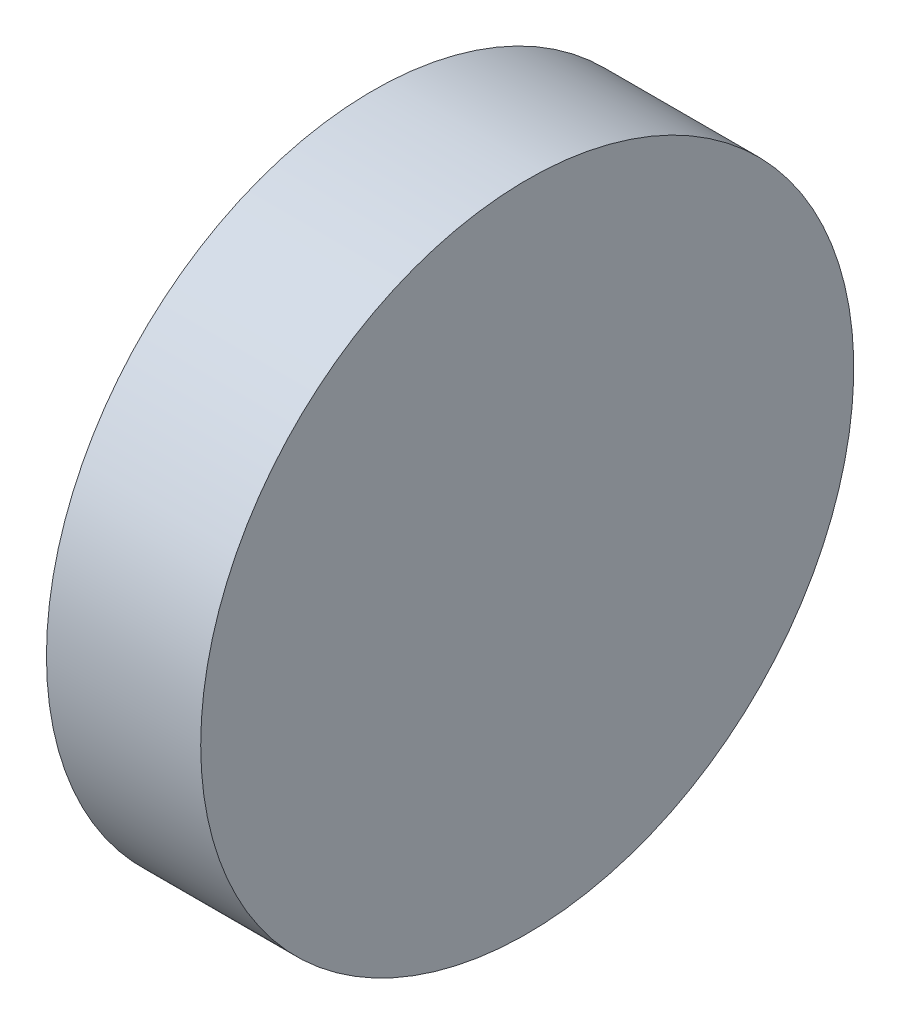
ISO-10303-21;
HEADER;
FILE_DESCRIPTION(('STEP AP214'),'2;1');
FILE_NAME('part.step','',(''),(''),'','','');
FILE_SCHEMA(('AUTOMOTIVE_DESIGN { 1 0 10303 214 1 1 1 1 }'));
ENDSEC;
DATA;
#1=APPLICATION_CONTEXT('core data for automotive mechanical design processes');
#2=APPLICATION_PROTOCOL_DEFINITION('international standard','automotive_design',2000,#1);
#3=PRODUCT_CONTEXT('',#1,'mechanical');
#4=PRODUCT('Part','Part','',(#3));
#5=PRODUCT_RELATED_PRODUCT_CATEGORY('part','',(#4));
#6=PRODUCT_DEFINITION_FORMATION('','',#4);
#7=PRODUCT_DEFINITION_CONTEXT('part definition',#1,'design');
#8=PRODUCT_DEFINITION('design','',#6,#7);
#9=PRODUCT_DEFINITION_SHAPE('','',#8);
#10=(LENGTH_UNIT() NAMED_UNIT(*) SI_UNIT(.MILLI.,.METRE.));
#11=(NAMED_UNIT(*) PLANE_ANGLE_UNIT() SI_UNIT($,.RADIAN.));
#12=(NAMED_UNIT(*) SI_UNIT($,.STERADIAN.) SOLID_ANGLE_UNIT());
#13=UNCERTAINTY_MEASURE_WITH_UNIT(LENGTH_MEASURE(1.E-05),#10,'distance_accuracy_value','');
#14=(GEOMETRIC_REPRESENTATION_CONTEXT(3) GLOBAL_UNCERTAINTY_ASSIGNED_CONTEXT((#13)) GLOBAL_UNIT_ASSIGNED_CONTEXT((#10,
#11,#12)) REPRESENTATION_CONTEXT('',''));
#15=CARTESIAN_POINT('',(0.,0.,0.));
#16=DIRECTION('',(0.,0.,1.));
#17=DIRECTION('',(1.,0.,0.));
#18=AXIS2_PLACEMENT_3D('',#15,#16,#17);
#19=CARTESIAN_POINT('',(-3.,0.,0.));
#20=DIRECTION('',(-1.,0.,0.));
#21=DIRECTION('',(0.,0.,1.));
#22=AXIS2_PLACEMENT_3D('',#19,#20,#21);
#23=CYLINDRICAL_SURFACE('',#22,12.7);
#24=CARTESIAN_POINT('',(-3.,0.,0.));
#25=DIRECTION('',(-1.,0.,0.));
#26=DIRECTION('',(0.,0.,1.));
#27=AXIS2_PLACEMENT_3D('',#24,#25,#26);
#28=CIRCLE('',#27,12.7);
#29=CARTESIAN_POINT('',(-3.,0.,12.7));
#30=VERTEX_POINT('',#29);
#31=EDGE_CURVE('E39',#30,#30,#28,.T.);
#32=ORIENTED_EDGE('',*,*,#31,.F.);
#33=EDGE_LOOP('',(#32));
#34=FACE_BOUND('',#33,.T.);
#35=CARTESIAN_POINT('',(3.,0.,0.));
#36=DIRECTION('',(-1.,0.,0.));
#37=DIRECTION('',(0.,0.,1.));
#38=AXIS2_PLACEMENT_3D('',#35,#36,#37);
#39=CIRCLE('',#38,12.7);
#40=CARTESIAN_POINT('',(3.,0.,12.7));
#41=VERTEX_POINT('',#40);
#42=EDGE_CURVE('E10',#41,#41,#39,.T.);
#43=ORIENTED_EDGE('',*,*,#42,.T.);
#44=EDGE_LOOP('',(#43));
#45=FACE_BOUND('',#44,.T.);
#46=ADVANCED_FACE('F33',(#34,#45),#23,.T.);
#47=CARTESIAN_POINT('',(3.,12.7,0.));
#48=DIRECTION('',(-1.,0.,0.));
#49=DIRECTION('',(0.,0.,1.));
#50=AXIS2_PLACEMENT_3D('',#47,#48,#49);
#51=PLANE('',#50);
#52=ORIENTED_EDGE('',*,*,#42,.F.);
#53=EDGE_LOOP('',(#52));
#54=FACE_BOUND('',#53,.T.);
#55=ADVANCED_FACE('F48',(#54),#51,.F.);
#56=CARTESIAN_POINT('',(-3.,12.7,0.));
#57=DIRECTION('',(1.,0.,0.));
#58=DIRECTION('',(0.,0.,-1.));
#59=AXIS2_PLACEMENT_3D('',#56,#57,#58);
#60=PLANE('',#59);
#61=ORIENTED_EDGE('',*,*,#31,.T.);
#62=EDGE_LOOP('',(#61));
#63=FACE_BOUND('',#62,.T.);
#64=ADVANCED_FACE('F45',(#63),#60,.F.);
#65=CLOSED_SHELL('',(#46,#55,#64));
#66=MANIFOLD_SOLID_BREP('B2',#65);
#67=ADVANCED_BREP_SHAPE_REPRESENTATION('',(#18,#66),#14);
#68=SHAPE_DEFINITION_REPRESENTATION(#9,#67);
ENDSEC;
END-ISO-10303-21;
